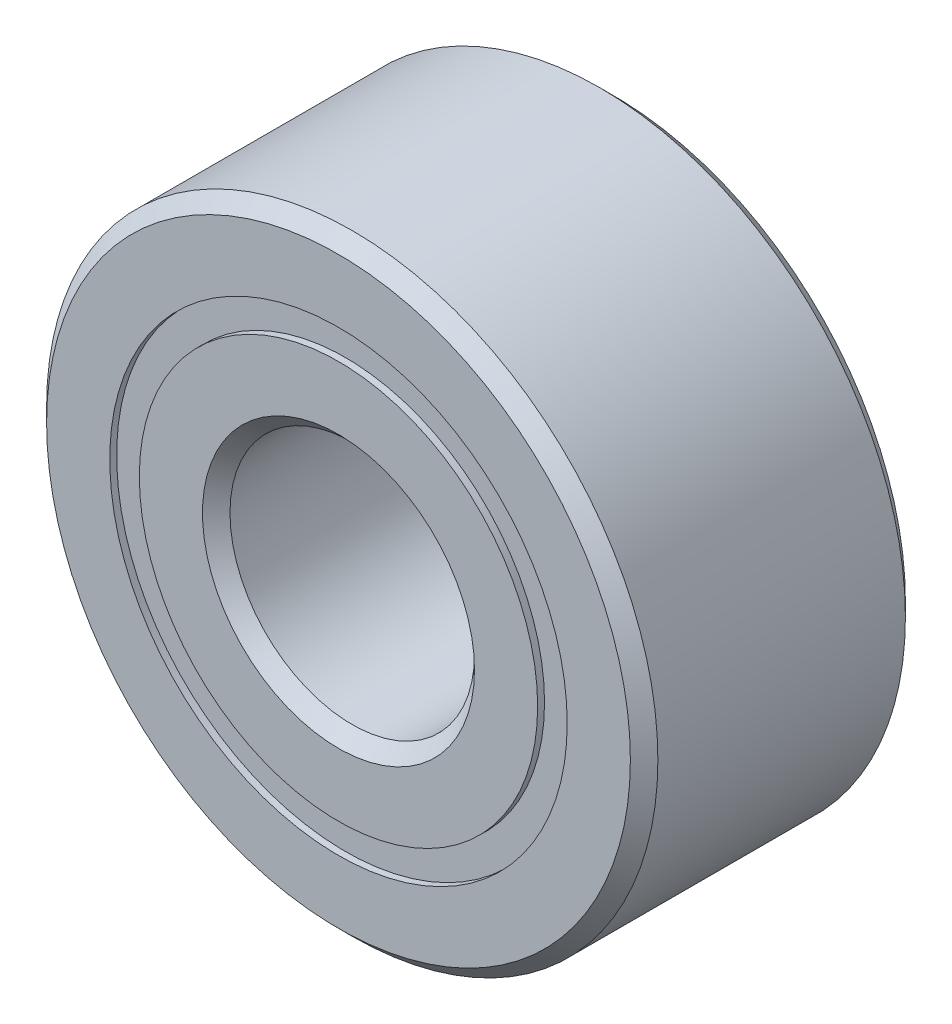
ISO-10303-21;
HEADER;
FILE_DESCRIPTION(('STEP AP214'),'2;1');
FILE_NAME('part.step','',(''),(''),'','','');
FILE_SCHEMA(('AUTOMOTIVE_DESIGN { 1 0 10303 214 1 1 1 1 }'));
ENDSEC;
DATA;
#1=APPLICATION_CONTEXT('core data for automotive mechanical design processes');
#2=APPLICATION_PROTOCOL_DEFINITION('international standard','automotive_design',2000,#1);
#3=PRODUCT_CONTEXT('',#1,'mechanical');
#4=PRODUCT('Part','Part','',(#3));
#5=PRODUCT_RELATED_PRODUCT_CATEGORY('part','',(#4));
#6=PRODUCT_DEFINITION_FORMATION('','',#4);
#7=PRODUCT_DEFINITION_CONTEXT('part definition',#1,'design');
#8=PRODUCT_DEFINITION('design','',#6,#7);
#9=PRODUCT_DEFINITION_SHAPE('','',#8);
#10=(LENGTH_UNIT() NAMED_UNIT(*) SI_UNIT(.MILLI.,.METRE.));
#11=(NAMED_UNIT(*) PLANE_ANGLE_UNIT() SI_UNIT($,.RADIAN.));
#12=(NAMED_UNIT(*) SI_UNIT($,.STERADIAN.) SOLID_ANGLE_UNIT());
#13=UNCERTAINTY_MEASURE_WITH_UNIT(LENGTH_MEASURE(1.E-05),#10,'distance_accuracy_value','');
#14=(GEOMETRIC_REPRESENTATION_CONTEXT(3) GLOBAL_UNCERTAINTY_ASSIGNED_CONTEXT((#13)) GLOBAL_UNIT_ASSIGNED_CONTEXT((#10,
#11,#12)) REPRESENTATION_CONTEXT('',''));
#15=CARTESIAN_POINT('',(0.,0.,0.));
#16=DIRECTION('',(0.,0.,1.));
#17=DIRECTION('',(1.,0.,0.));
#18=AXIS2_PLACEMENT_3D('',#15,#16,#17);
#19=CARTESIAN_POINT('',(0.,2.97004851648352,-1.696339));
#20=DIRECTION('',(0.,0.,1.));
#21=DIRECTION('',(1.,0.,0.));
#22=AXIS2_PLACEMENT_3D('',#19,#20,#21);
#23=PLANE('',#22);
#24=CARTESIAN_POINT('',(0.,0.,-1.696339));
#25=DIRECTION('',(0.,0.,1.));
#26=DIRECTION('',(1.,0.,0.));
#27=AXIS2_PLACEMENT_3D('',#24,#25,#26);
#28=CIRCLE('',#27,2.97004851648352);
#29=CARTESIAN_POINT('',(2.97004851648352,0.,-1.696339));
#30=VERTEX_POINT('',#29);
#31=EDGE_CURVE('E56',#30,#30,#28,.T.);
#32=ORIENTED_EDGE('',*,*,#31,.F.);
#33=EDGE_LOOP('',(#32));
#34=FACE_BOUND('',#33,.T.);
#35=CARTESIAN_POINT('',(0.,0.,-1.696339));
#36=DIRECTION('',(0.,0.,1.));
#37=DIRECTION('',(1.,0.,0.));
#38=AXIS2_PLACEMENT_3D('',#35,#36,#37);
#39=CIRCLE('',#38,2.58620148351648);
#40=CARTESIAN_POINT('',(2.58620148351648,0.,-1.696339));
#41=VERTEX_POINT('',#40);
#42=EDGE_CURVE('E11',#41,#41,#39,.T.);
#43=ORIENTED_EDGE('',*,*,#42,.T.);
#44=EDGE_LOOP('',(#43));
#45=FACE_BOUND('',#44,.T.);
#46=ADVANCED_FACE('F42',(#34,#45),#23,.F.);
#47=CARTESIAN_POINT('',(0.,0.,1.78562));
#48=DIRECTION('',(0.,0.,1.));
#49=DIRECTION('',(1.,0.,0.));
#50=AXIS2_PLACEMENT_3D('',#47,#48,#49);
#51=CYLINDRICAL_SURFACE('',#50,2.58620148351648);
#52=ORIENTED_EDGE('',*,*,#42,.F.);
#53=EDGE_LOOP('',(#52));
#54=FACE_BOUND('',#53,.T.);
#55=CARTESIAN_POINT('',(0.,0.,-0.816486193822563));
#56=DIRECTION('',(0.,0.,1.));
#57=DIRECTION('',(1.,0.,0.));
#58=AXIS2_PLACEMENT_3D('',#55,#56,#57);
#59=CIRCLE('',#58,2.58620148351648);
#60=CARTESIAN_POINT('',(2.58620148351648,0.,-0.816486193822563));
#61=VERTEX_POINT('',#60);
#62=EDGE_CURVE('E48',#61,#61,#59,.T.);
#63=ORIENTED_EDGE('',*,*,#62,.T.);
#64=EDGE_LOOP('',(#63));
#65=FACE_BOUND('',#64,.T.);
#66=ADVANCED_FACE('F65',(#54,#65),#51,.F.);
#67=CARTESIAN_POINT('',(0.,2.97004851648352,-0.816486193822563));
#68=DIRECTION('',(0.,0.,-1.));
#69=DIRECTION('',(-1.,0.,0.));
#70=AXIS2_PLACEMENT_3D('',#67,#68,#69);
#71=PLANE('',#70);
#72=ORIENTED_EDGE('',*,*,#62,.F.);
#73=EDGE_LOOP('',(#72));
#74=FACE_BOUND('',#73,.T.);
#75=CARTESIAN_POINT('',(0.,0.,-0.816486193822563));
#76=DIRECTION('',(0.,0.,1.));
#77=DIRECTION('',(1.,0.,0.));
#78=AXIS2_PLACEMENT_3D('',#75,#76,#77);
#79=CIRCLE('',#78,2.97004851648352);
#80=CARTESIAN_POINT('',(2.97004851648352,0.,-0.816486193822563));
#81=VERTEX_POINT('',#80);
#82=EDGE_CURVE('E52',#81,#81,#79,.T.);
#83=ORIENTED_EDGE('',*,*,#82,.T.);
#84=EDGE_LOOP('',(#83));
#85=FACE_BOUND('',#84,.T.);
#86=ADVANCED_FACE('F69',(#74,#85),#71,.F.);
#87=CARTESIAN_POINT('',(0.,0.,1.78562));
#88=DIRECTION('',(0.,0.,1.));
#89=DIRECTION('',(1.,0.,0.));
#90=AXIS2_PLACEMENT_3D('',#87,#88,#89);
#91=CYLINDRICAL_SURFACE('',#90,2.97004851648352);
#92=ORIENTED_EDGE('',*,*,#82,.F.);
#93=EDGE_LOOP('',(#92));
#94=FACE_BOUND('',#93,.T.);
#95=ORIENTED_EDGE('',*,*,#31,.T.);
#96=EDGE_LOOP('',(#95));
#97=FACE_BOUND('',#96,.T.);
#98=ADVANCED_FACE('F62',(#94,#97),#91,.T.);
#99=CLOSED_SHELL('',(#46,#66,#86,#98));
#100=MANIFOLD_SOLID_BREP('B2',#99);
#101=CARTESIAN_POINT('',(0.,2.97004851648352,1.696339));
#102=DIRECTION('',(0.,0.,-1.));
#103=DIRECTION('',(-1.,0.,0.));
#104=AXIS2_PLACEMENT_3D('',#101,#102,#103);
#105=PLANE('',#104);
#106=CARTESIAN_POINT('',(0.,0.,1.696339));
#107=DIRECTION('',(0.,0.,1.));
#108=DIRECTION('',(1.,0.,0.));
#109=AXIS2_PLACEMENT_3D('',#106,#107,#108);
#110=CIRCLE('',#109,2.58620148351648);
#111=CARTESIAN_POINT('',(2.58620148351648,0.,1.696339));
#112=VERTEX_POINT('',#111);
#113=EDGE_CURVE('E41',#112,#112,#110,.T.);
#114=ORIENTED_EDGE('',*,*,#113,.F.);
#115=EDGE_LOOP('',(#114));
#116=FACE_BOUND('',#115,.T.);
#117=CARTESIAN_POINT('',(0.,0.,1.696339));
#118=DIRECTION('',(0.,0.,1.));
#119=DIRECTION('',(1.,0.,0.));
#120=AXIS2_PLACEMENT_3D('',#117,#118,#119);
#121=CIRCLE('',#120,2.97004851648352);
#122=CARTESIAN_POINT('',(2.97004851648352,0.,1.696339));
#123=VERTEX_POINT('',#122);
#124=EDGE_CURVE('E124',#123,#123,#121,.T.);
#125=ORIENTED_EDGE('',*,*,#124,.T.);
#126=EDGE_LOOP('',(#125));
#127=FACE_BOUND('',#126,.T.);
#128=ADVANCED_FACE('F110',(#116,#127),#105,.F.);
#129=CARTESIAN_POINT('',(0.,0.,1.78562));
#130=DIRECTION('',(0.,0.,1.));
#131=DIRECTION('',(1.,0.,0.));
#132=AXIS2_PLACEMENT_3D('',#129,#130,#131);
#133=CYLINDRICAL_SURFACE('',#132,2.58620148351648);
#134=CARTESIAN_POINT('',(0.,0.,0.816486193822562));
#135=DIRECTION('',(0.,0.,1.));
#136=DIRECTION('',(1.,0.,0.));
#137=AXIS2_PLACEMENT_3D('',#134,#135,#136);
#138=CIRCLE('',#137,2.58620148351648);
#139=CARTESIAN_POINT('',(2.58620148351648,0.,0.816486193822562));
#140=VERTEX_POINT('',#139);
#141=EDGE_CURVE('E116',#140,#140,#138,.T.);
#142=ORIENTED_EDGE('',*,*,#141,.F.);
#143=EDGE_LOOP('',(#142));
#144=FACE_BOUND('',#143,.T.);
#145=ORIENTED_EDGE('',*,*,#113,.T.);
#146=EDGE_LOOP('',(#145));
#147=FACE_BOUND('',#146,.T.);
#148=ADVANCED_FACE('F139',(#144,#147),#133,.F.);
#149=CARTESIAN_POINT('',(0.,2.97004851648352,0.816486193822562));
#150=DIRECTION('',(0.,0.,1.));
#151=DIRECTION('',(1.,0.,0.));
#152=AXIS2_PLACEMENT_3D('',#149,#150,#151);
#153=PLANE('',#152);
#154=CARTESIAN_POINT('',(0.,0.,0.816486193822562));
#155=DIRECTION('',(0.,0.,1.));
#156=DIRECTION('',(1.,0.,0.));
#157=AXIS2_PLACEMENT_3D('',#154,#155,#156);
#158=CIRCLE('',#157,2.97004851648352);
#159=CARTESIAN_POINT('',(2.97004851648352,0.,0.816486193822562));
#160=VERTEX_POINT('',#159);
#161=EDGE_CURVE('E120',#160,#160,#158,.T.);
#162=ORIENTED_EDGE('',*,*,#161,.F.);
#163=EDGE_LOOP('',(#162));
#164=FACE_BOUND('',#163,.T.);
#165=ORIENTED_EDGE('',*,*,#141,.T.);
#166=EDGE_LOOP('',(#165));
#167=FACE_BOUND('',#166,.T.);
#168=ADVANCED_FACE('F134',(#164,#167),#153,.F.);
#169=CARTESIAN_POINT('',(0.,0.,1.78562));
#170=DIRECTION('',(0.,0.,1.));
#171=DIRECTION('',(1.,0.,0.));
#172=AXIS2_PLACEMENT_3D('',#169,#170,#171);
#173=CYLINDRICAL_SURFACE('',#172,2.97004851648352);
#174=ORIENTED_EDGE('',*,*,#124,.F.);
#175=EDGE_LOOP('',(#174));
#176=FACE_BOUND('',#175,.T.);
#177=ORIENTED_EDGE('',*,*,#161,.T.);
#178=EDGE_LOOP('',(#177));
#179=FACE_BOUND('',#178,.T.);
#180=ADVANCED_FACE('F131',(#176,#179),#173,.T.);
#181=CLOSED_SHELL('',(#128,#148,#168,#180));
#182=MANIFOLD_SOLID_BREP('B6',#181);
#183=CARTESIAN_POINT('',(-1.632940904025,2.24755033749792,0.));
#184=DIRECTION('',(0.,0.,1.));
#185=DIRECTION('',(-0.587785252292462,0.809016994374955,0.));
#186=AXIS2_PLACEMENT_3D('',#183,#184,#185);
#187=SPHERICAL_SURFACE('',#186,0.816486193822563);
#188=CARTESIAN_POINT('',(-1.632940904025,2.24755033749792,0.816486193822562));
#189=VERTEX_POINT('',#188);
#190=VERTEX_LOOP('',#189);
#191=FACE_BOUND('',#190,.T.);
#192=ADVANCED_FACE('F177',(#191),#187,.T.);
#193=CLOSED_SHELL('',(#192));
#194=MANIFOLD_SOLID_BREP('B36',#193);
#195=CARTESIAN_POINT('',(-2.64215388433246,0.858487837497931,0.));
#196=DIRECTION('',(0.,0.,1.));
#197=DIRECTION('',(-0.95105651629515,0.309016994374958,0.));
#198=AXIS2_PLACEMENT_3D('',#195,#196,#197);
#199=SPHERICAL_SURFACE('',#198,0.816486193822563);
#200=CARTESIAN_POINT('',(-2.64215388433246,0.858487837497931,0.816486193822562));
#201=VERTEX_POINT('',#200);
#202=VERTEX_LOOP('',#201);
#203=FACE_BOUND('',#202,.T.);
#204=ADVANCED_FACE('F197',(#203),#199,.T.);
#205=CLOSED_SHELL('',(#204));
#206=MANIFOLD_SOLID_BREP('B106',#205);
#207=CARTESIAN_POINT('',(-2.64215388433248,-0.858487837497875,0.));
#208=DIRECTION('',(0.,0.,1.));
#209=DIRECTION('',(-0.951056516295157,-0.309016994374938,0.));
#210=AXIS2_PLACEMENT_3D('',#207,#208,#209);
#211=SPHERICAL_SURFACE('',#210,0.816486193822563);
#212=CARTESIAN_POINT('',(-2.64215388433248,-0.858487837497875,0.816486193822562));
#213=VERTEX_POINT('',#212);
#214=VERTEX_LOOP('',#213);
#215=FACE_BOUND('',#214,.T.);
#216=ADVANCED_FACE('F217',(#215),#211,.T.);
#217=CLOSED_SHELL('',(#216));
#218=MANIFOLD_SOLID_BREP('B173',#217);
#219=CARTESIAN_POINT('',(-1.63294090402505,-2.24755033749789,0.));
#220=DIRECTION('',(0.,0.,1.));
#221=DIRECTION('',(-0.58778525229248,-0.809016994374942,0.));
#222=AXIS2_PLACEMENT_3D('',#219,#220,#221);
#223=SPHERICAL_SURFACE('',#222,0.816486193822563);
#224=CARTESIAN_POINT('',(-1.63294090402505,-2.24755033749789,0.816486193822562));
#225=VERTEX_POINT('',#224);
#226=VERTEX_LOOP('',#225);
#227=FACE_BOUND('',#226,.T.);
#228=ADVANCED_FACE('F237',(#227),#223,.T.);
#229=CLOSED_SHELL('',(#228));
#230=MANIFOLD_SOLID_BREP('B193',#229);
#231=CARTESIAN_POINT('',(0.,-2.778125,0.));
#232=DIRECTION('',(0.,0.,1.));
#233=DIRECTION('',(0.,-1.,0.));
#234=AXIS2_PLACEMENT_3D('',#231,#232,#233);
#235=SPHERICAL_SURFACE('',#234,0.816486193822563);
#236=CARTESIAN_POINT('',(0.,-2.778125,0.816486193822562));
#237=VERTEX_POINT('',#236);
#238=VERTEX_LOOP('',#237);
#239=FACE_BOUND('',#238,.T.);
#240=ADVANCED_FACE('F257',(#239),#235,.T.);
#241=CLOSED_SHELL('',(#240));
#242=MANIFOLD_SOLID_BREP('B213',#241);
#243=CARTESIAN_POINT('',(1.63294090402501,-2.24755033749791,0.));
#244=DIRECTION('',(0.,0.,1.));
#245=DIRECTION('',(0.587785252292469,-0.809016994374951,0.));
#246=AXIS2_PLACEMENT_3D('',#243,#244,#245);
#247=SPHERICAL_SURFACE('',#246,0.816486193822563);
#248=CARTESIAN_POINT('',(1.63294090402501,-2.24755033749791,0.816486193822562));
#249=VERTEX_POINT('',#248);
#250=VERTEX_LOOP('',#249);
#251=FACE_BOUND('',#250,.T.);
#252=ADVANCED_FACE('F277',(#251),#247,.T.);
#253=CLOSED_SHELL('',(#252));
#254=MANIFOLD_SOLID_BREP('B233',#253);
#255=CARTESIAN_POINT('',(2.64215388433247,-0.858487837497912,0.));
#256=DIRECTION('',(0.,0.,1.));
#257=DIRECTION('',(0.951056516295152,-0.309016994374952,0.));
#258=AXIS2_PLACEMENT_3D('',#255,#256,#257);
#259=SPHERICAL_SURFACE('',#258,0.816486193822563);
#260=CARTESIAN_POINT('',(2.64215388433247,-0.858487837497912,0.816486193822562));
#261=VERTEX_POINT('',#260);
#262=VERTEX_LOOP('',#261);
#263=FACE_BOUND('',#262,.T.);
#264=ADVANCED_FACE('F297',(#263),#259,.T.);
#265=CLOSED_SHELL('',(#264));
#266=MANIFOLD_SOLID_BREP('B253',#265);
#267=CARTESIAN_POINT('',(2.64215388433248,0.858487837497893,0.));
#268=DIRECTION('',(0.,0.,1.));
#269=DIRECTION('',(0.951056516295155,0.309016994374945,0.));
#270=AXIS2_PLACEMENT_3D('',#267,#268,#269);
#271=SPHERICAL_SURFACE('',#270,0.816486193822563);
#272=CARTESIAN_POINT('',(2.64215388433248,0.858487837497893,0.816486193822562));
#273=VERTEX_POINT('',#272);
#274=VERTEX_LOOP('',#273);
#275=FACE_BOUND('',#274,.T.);
#276=ADVANCED_FACE('F317',(#275),#271,.T.);
#277=CLOSED_SHELL('',(#276));
#278=MANIFOLD_SOLID_BREP('B273',#277);
#279=CARTESIAN_POINT('',(1.63294090402503,2.2475503374979,0.));
#280=DIRECTION('',(0.,0.,1.));
#281=DIRECTION('',(0.587785252292474,0.809016994374947,0.));
#282=AXIS2_PLACEMENT_3D('',#279,#280,#281);
#283=SPHERICAL_SURFACE('',#282,0.816486193822563);
#284=CARTESIAN_POINT('',(1.63294090402503,2.2475503374979,0.816486193822562));
#285=VERTEX_POINT('',#284);
#286=VERTEX_LOOP('',#285);
#287=FACE_BOUND('',#286,.T.);
#288=ADVANCED_FACE('F337',(#287),#283,.T.);
#289=CLOSED_SHELL('',(#288));
#290=MANIFOLD_SOLID_BREP('B293',#289);
#291=CARTESIAN_POINT('',(0.,2.778125,0.));
#292=DIRECTION('',(0.,0.,1.));
#293=DIRECTION('',(0.,1.,0.));
#294=AXIS2_PLACEMENT_3D('',#291,#292,#293);
#295=SPHERICAL_SURFACE('',#294,0.816486193822563);
#296=CARTESIAN_POINT('',(0.,2.778125,0.816486193822562));
#297=VERTEX_POINT('',#296);
#298=VERTEX_LOOP('',#297);
#299=FACE_BOUND('',#298,.T.);
#300=ADVANCED_FACE('F360',(#299),#295,.T.);
#301=CLOSED_SHELL('',(#300));
#302=MANIFOLD_SOLID_BREP('B313',#301);
#303=CARTESIAN_POINT('',(0.,2.58620148351648,1.78562));
#304=DIRECTION('',(0.,0.,-1.));
#305=DIRECTION('',(-1.,0.,0.));
#306=AXIS2_PLACEMENT_3D('',#303,#304,#305);
#307=PLANE('',#306);
#308=CARTESIAN_POINT('',(0.,0.,1.78562));
#309=DIRECTION('',(0.,0.,1.));
#310=DIRECTION('',(1.,0.,0.));
#311=AXIS2_PLACEMENT_3D('',#308,#309,#310);
#312=CIRCLE('',#311,1.766062);
#313=CARTESIAN_POINT('',(1.766062,0.,1.78562));
#314=VERTEX_POINT('',#313);
#315=EDGE_CURVE('E408',#314,#314,#312,.T.);
#316=ORIENTED_EDGE('',*,*,#315,.F.);
#317=EDGE_LOOP('',(#316));
#318=FACE_BOUND('',#317,.T.);
#319=CARTESIAN_POINT('',(0.,0.,1.78562));
#320=DIRECTION('',(0.,0.,1.));
#321=DIRECTION('',(1.,0.,0.));
#322=AXIS2_PLACEMENT_3D('',#319,#320,#321);
#323=CIRCLE('',#322,2.58620148351648);
#324=CARTESIAN_POINT('',(2.58620148351648,0.,1.78562));
#325=VERTEX_POINT('',#324);
#326=EDGE_CURVE('E359',#325,#325,#323,.T.);
#327=ORIENTED_EDGE('',*,*,#326,.T.);
#328=EDGE_LOOP('',(#327));
#329=FACE_BOUND('',#328,.T.);
#330=ADVANCED_FACE('F380',(#318,#329),#307,.F.);
#331=CARTESIAN_POINT('',(0.,0.,1.78562));
#332=DIRECTION('',(0.,0.,1.));
#333=DIRECTION('',(1.,0.,0.));
#334=AXIS2_PLACEMENT_3D('',#331,#332,#333);
#335=CYLINDRICAL_SURFACE('',#334,2.58620148351648);
#336=ORIENTED_EDGE('',*,*,#326,.F.);
#337=EDGE_LOOP('',(#336));
#338=FACE_BOUND('',#337,.T.);
#339=CARTESIAN_POINT('',(0.,0.,0.793608888888889));
#340=DIRECTION('',(0.,0.,1.));
#341=DIRECTION('',(1.,0.,0.));
#342=AXIS2_PLACEMENT_3D('',#339,#340,#341);
#343=CIRCLE('',#342,2.58620148351648);
#344=CARTESIAN_POINT('',(2.58620148351648,0.,0.793608888888889));
#345=VERTEX_POINT('',#344);
#346=EDGE_CURVE('E386',#345,#345,#343,.T.);
#347=ORIENTED_EDGE('',*,*,#346,.T.);
#348=EDGE_LOOP('',(#347));
#349=FACE_BOUND('',#348,.T.);
#350=ADVANCED_FACE('F415',(#338,#349),#335,.T.);
#351=CARTESIAN_POINT('',(0.,0.,0.));
#352=DIRECTION('',(0.,0.,1.));
#353=DIRECTION('',(1.,0.,0.));
#354=AXIS2_PLACEMENT_3D('',#351,#352,#353);
#355=TOROIDAL_SURFACE('',#354,2.77812499999999,0.816486193822561);
#356=ORIENTED_EDGE('',*,*,#346,.F.);
#357=EDGE_LOOP('',(#356));
#358=FACE_BOUND('',#357,.T.);
#359=CARTESIAN_POINT('',(0.,0.,-0.793608888888891));
#360=DIRECTION('',(0.,0.,1.));
#361=DIRECTION('',(1.,0.,0.));
#362=AXIS2_PLACEMENT_3D('',#359,#360,#361);
#363=CIRCLE('',#362,2.58620148351648);
#364=CARTESIAN_POINT('',(2.58620148351648,0.,-0.793608888888891));
#365=VERTEX_POINT('',#364);
#366=EDGE_CURVE('E390',#365,#365,#363,.T.);
#367=ORIENTED_EDGE('',*,*,#366,.T.);
#368=EDGE_LOOP('',(#367));
#369=FACE_BOUND('',#368,.T.);
#370=ADVANCED_FACE('F419',(#358,#369),#355,.F.);
#371=CARTESIAN_POINT('',(0.,0.,1.78562));
#372=DIRECTION('',(0.,0.,1.));
#373=DIRECTION('',(1.,0.,0.));
#374=AXIS2_PLACEMENT_3D('',#371,#372,#373);
#375=CYLINDRICAL_SURFACE('',#374,2.58620148351648);
#376=ORIENTED_EDGE('',*,*,#366,.F.);
#377=EDGE_LOOP('',(#376));
#378=FACE_BOUND('',#377,.T.);
#379=CARTESIAN_POINT('',(0.,0.,-1.78562));
#380=DIRECTION('',(0.,0.,1.));
#381=DIRECTION('',(1.,0.,0.));
#382=AXIS2_PLACEMENT_3D('',#379,#380,#381);
#383=CIRCLE('',#382,2.58620148351648);
#384=CARTESIAN_POINT('',(2.58620148351648,0.,-1.78562));
#385=VERTEX_POINT('',#384);
#386=EDGE_CURVE('E394',#385,#385,#383,.T.);
#387=ORIENTED_EDGE('',*,*,#386,.T.);
#388=EDGE_LOOP('',(#387));
#389=FACE_BOUND('',#388,.T.);
#390=ADVANCED_FACE('F424',(#378,#389),#375,.T.);
#391=CARTESIAN_POINT('',(0.,1.766062,-1.78562));
#392=DIRECTION('',(0.,0.,1.));
#393=DIRECTION('',(1.,0.,0.));
#394=AXIS2_PLACEMENT_3D('',#391,#392,#393);
#395=PLANE('',#394);
#396=ORIENTED_EDGE('',*,*,#386,.F.);
#397=EDGE_LOOP('',(#396));
#398=FACE_BOUND('',#397,.T.);
#399=CARTESIAN_POINT('',(0.,0.,-1.78562));
#400=DIRECTION('',(0.,0.,1.));
#401=DIRECTION('',(1.,0.,0.));
#402=AXIS2_PLACEMENT_3D('',#399,#400,#401);
#403=CIRCLE('',#402,1.766062);
#404=CARTESIAN_POINT('',(1.766062,0.,-1.78562));
#405=VERTEX_POINT('',#404);
#406=EDGE_CURVE('E399',#405,#405,#403,.T.);
#407=ORIENTED_EDGE('',*,*,#406,.T.);
#408=EDGE_LOOP('',(#407));
#409=FACE_BOUND('',#408,.T.);
#410=ADVANCED_FACE('F430',(#398,#409),#395,.F.);
#411=CARTESIAN_POINT('',(0.,0.,-1.607058));
#412=DIRECTION('',(0.,0.,-1.));
#413=DIRECTION('',(-1.,0.,0.));
#414=AXIS2_PLACEMENT_3D('',#411,#412,#413);
#415=CONICAL_SURFACE('',#414,1.5875,0.785398163397451);
#416=ORIENTED_EDGE('',*,*,#406,.F.);
#417=EDGE_LOOP('',(#416));
#418=FACE_BOUND('',#417,.T.);
#419=CARTESIAN_POINT('',(0.,0.,-1.607058));
#420=DIRECTION('',(0.,0.,1.));
#421=DIRECTION('',(1.,0.,0.));
#422=AXIS2_PLACEMENT_3D('',#419,#420,#421);
#423=CIRCLE('',#422,1.5875);
#424=CARTESIAN_POINT('',(1.5875,0.,-1.607058));
#425=VERTEX_POINT('',#424);
#426=EDGE_CURVE('E402',#425,#425,#423,.T.);
#427=ORIENTED_EDGE('',*,*,#426,.T.);
#428=EDGE_LOOP('',(#427));
#429=FACE_BOUND('',#428,.T.);
#430=ADVANCED_FACE('F434',(#418,#429),#415,.F.);
#431=CARTESIAN_POINT('',(0.,0.,1.78562));
#432=DIRECTION('',(0.,0.,1.));
#433=DIRECTION('',(1.,0.,0.));
#434=AXIS2_PLACEMENT_3D('',#431,#432,#433);
#435=CYLINDRICAL_SURFACE('',#434,1.5875);
#436=ORIENTED_EDGE('',*,*,#426,.F.);
#437=EDGE_LOOP('',(#436));
#438=FACE_BOUND('',#437,.T.);
#439=CARTESIAN_POINT('',(0.,0.,1.607058));
#440=DIRECTION('',(0.,0.,1.));
#441=DIRECTION('',(1.,0.,0.));
#442=AXIS2_PLACEMENT_3D('',#439,#440,#441);
#443=CIRCLE('',#442,1.5875);
#444=CARTESIAN_POINT('',(1.5875,0.,1.607058));
#445=VERTEX_POINT('',#444);
#446=EDGE_CURVE('E405',#445,#445,#443,.T.);
#447=ORIENTED_EDGE('',*,*,#446,.T.);
#448=EDGE_LOOP('',(#447));
#449=FACE_BOUND('',#448,.T.);
#450=ADVANCED_FACE('F438',(#438,#449),#435,.F.);
#451=CARTESIAN_POINT('',(0.,0.,1.78562));
#452=DIRECTION('',(0.,0.,1.));
#453=DIRECTION('',(1.,0.,0.));
#454=AXIS2_PLACEMENT_3D('',#451,#452,#453);
#455=CONICAL_SURFACE('',#454,1.766062,0.785398163397447);
#456=ORIENTED_EDGE('',*,*,#446,.F.);
#457=EDGE_LOOP('',(#456));
#458=FACE_BOUND('',#457,.T.);
#459=ORIENTED_EDGE('',*,*,#315,.T.);
#460=EDGE_LOOP('',(#459));
#461=FACE_BOUND('',#460,.T.);
#462=ADVANCED_FACE('F412',(#458,#461),#455,.F.);
#463=CLOSED_SHELL('',(#330,#350,#370,#390,#410,#430,#450,#462));
#464=MANIFOLD_SOLID_BREP('B333',#463);
#465=CARTESIAN_POINT('',(0.,0.,1.607058));
#466=DIRECTION('',(0.,0.,-1.));
#467=DIRECTION('',(-1.,0.,0.));
#468=AXIS2_PLACEMENT_3D('',#465,#466,#467);
#469=CONICAL_SURFACE('',#468,3.96875,0.785398163397447);
#470=CARTESIAN_POINT('',(0.,0.,1.78562));
#471=DIRECTION('',(0.,0.,1.));
#472=DIRECTION('',(1.,0.,0.));
#473=AXIS2_PLACEMENT_3D('',#470,#471,#472);
#474=CIRCLE('',#473,3.790188);
#475=CARTESIAN_POINT('',(3.790188,0.,1.78562));
#476=VERTEX_POINT('',#475);
#477=EDGE_CURVE('E530',#476,#476,#474,.T.);
#478=ORIENTED_EDGE('',*,*,#477,.F.);
#479=EDGE_LOOP('',(#478));
#480=FACE_BOUND('',#479,.T.);
#481=CARTESIAN_POINT('',(0.,0.,1.607058));
#482=DIRECTION('',(0.,0.,1.));
#483=DIRECTION('',(1.,0.,0.));
#484=AXIS2_PLACEMENT_3D('',#481,#482,#483);
#485=CIRCLE('',#484,3.96875);
#486=CARTESIAN_POINT('',(3.96875,0.,1.607058));
#487=VERTEX_POINT('',#486);
#488=EDGE_CURVE('E379',#487,#487,#485,.T.);
#489=ORIENTED_EDGE('',*,*,#488,.T.);
#490=EDGE_LOOP('',(#489));
#491=FACE_BOUND('',#490,.T.);
#492=ADVANCED_FACE('F502',(#480,#491),#469,.T.);
#493=CARTESIAN_POINT('',(0.,0.,1.78562));
#494=DIRECTION('',(0.,0.,1.));
#495=DIRECTION('',(1.,0.,0.));
#496=AXIS2_PLACEMENT_3D('',#493,#494,#495);
#497=CYLINDRICAL_SURFACE('',#496,3.96875);
#498=ORIENTED_EDGE('',*,*,#488,.F.);
#499=EDGE_LOOP('',(#498));
#500=FACE_BOUND('',#499,.T.);
#501=CARTESIAN_POINT('',(0.,0.,-1.607058));
#502=DIRECTION('',(0.,0.,1.));
#503=DIRECTION('',(1.,0.,0.));
#504=AXIS2_PLACEMENT_3D('',#501,#502,#503);
#505=CIRCLE('',#504,3.96875);
#506=CARTESIAN_POINT('',(3.96875,0.,-1.607058));
#507=VERTEX_POINT('',#506);
#508=EDGE_CURVE('E508',#507,#507,#505,.T.);
#509=ORIENTED_EDGE('',*,*,#508,.T.);
#510=EDGE_LOOP('',(#509));
#511=FACE_BOUND('',#510,.T.);
#512=ADVANCED_FACE('F537',(#500,#511),#497,.T.);
#513=CARTESIAN_POINT('',(0.,0.,-1.78562));
#514=DIRECTION('',(0.,0.,1.));
#515=DIRECTION('',(1.,0.,0.));
#516=AXIS2_PLACEMENT_3D('',#513,#514,#515);
#517=CONICAL_SURFACE('',#516,3.790188,0.785398163397446);
#518=ORIENTED_EDGE('',*,*,#508,.F.);
#519=EDGE_LOOP('',(#518));
#520=FACE_BOUND('',#519,.T.);
#521=CARTESIAN_POINT('',(0.,0.,-1.78562));
#522=DIRECTION('',(0.,0.,1.));
#523=DIRECTION('',(1.,0.,0.));
#524=AXIS2_PLACEMENT_3D('',#521,#522,#523);
#525=CIRCLE('',#524,3.790188);
#526=CARTESIAN_POINT('',(3.790188,0.,-1.78562));
#527=VERTEX_POINT('',#526);
#528=EDGE_CURVE('E512',#527,#527,#525,.T.);
#529=ORIENTED_EDGE('',*,*,#528,.T.);
#530=EDGE_LOOP('',(#529));
#531=FACE_BOUND('',#530,.T.);
#532=ADVANCED_FACE('F541',(#520,#531),#517,.T.);
#533=CARTESIAN_POINT('',(0.,3.790188,-1.78562));
#534=DIRECTION('',(0.,0.,1.));
#535=DIRECTION('',(1.,0.,0.));
#536=AXIS2_PLACEMENT_3D('',#533,#534,#535);
#537=PLANE('',#536);
#538=ORIENTED_EDGE('',*,*,#528,.F.);
#539=EDGE_LOOP('',(#538));
#540=FACE_BOUND('',#539,.T.);
#541=CARTESIAN_POINT('',(0.,0.,-1.78562));
#542=DIRECTION('',(0.,0.,1.));
#543=DIRECTION('',(1.,0.,0.));
#544=AXIS2_PLACEMENT_3D('',#541,#542,#543);
#545=CIRCLE('',#544,2.97004851648352);
#546=CARTESIAN_POINT('',(2.97004851648352,0.,-1.78562));
#547=VERTEX_POINT('',#546);
#548=EDGE_CURVE('E516',#547,#547,#545,.T.);
#549=ORIENTED_EDGE('',*,*,#548,.T.);
#550=EDGE_LOOP('',(#549));
#551=FACE_BOUND('',#550,.T.);
#552=ADVANCED_FACE('F546',(#540,#551),#537,.F.);
#553=CARTESIAN_POINT('',(0.,0.,1.78562));
#554=DIRECTION('',(0.,0.,1.));
#555=DIRECTION('',(1.,0.,0.));
#556=AXIS2_PLACEMENT_3D('',#553,#554,#555);
#557=CYLINDRICAL_SURFACE('',#556,2.97004851648352);
#558=ORIENTED_EDGE('',*,*,#548,.F.);
#559=EDGE_LOOP('',(#558));
#560=FACE_BOUND('',#559,.T.);
#561=CARTESIAN_POINT('',(0.,0.,-0.793608888888889));
#562=DIRECTION('',(0.,0.,1.));
#563=DIRECTION('',(1.,0.,0.));
#564=AXIS2_PLACEMENT_3D('',#561,#562,#563);
#565=CIRCLE('',#564,2.97004851648352);
#566=CARTESIAN_POINT('',(2.97004851648352,0.,-0.793608888888889));
#567=VERTEX_POINT('',#566);
#568=EDGE_CURVE('E521',#567,#567,#565,.T.);
#569=ORIENTED_EDGE('',*,*,#568,.T.);
#570=EDGE_LOOP('',(#569));
#571=FACE_BOUND('',#570,.T.);
#572=ADVANCED_FACE('F552',(#560,#571),#557,.F.);
#573=CARTESIAN_POINT('',(0.,0.,0.));
#574=DIRECTION('',(0.,0.,1.));
#575=DIRECTION('',(1.,0.,0.));
#576=AXIS2_PLACEMENT_3D('',#573,#574,#575);
#577=TOROIDAL_SURFACE('',#576,2.778125,0.816486193822563);
#578=ORIENTED_EDGE('',*,*,#568,.F.);
#579=EDGE_LOOP('',(#578));
#580=FACE_BOUND('',#579,.T.);
#581=CARTESIAN_POINT('',(0.,0.,0.793608888888888));
#582=DIRECTION('',(0.,0.,1.));
#583=DIRECTION('',(1.,0.,0.));
#584=AXIS2_PLACEMENT_3D('',#581,#582,#583);
#585=CIRCLE('',#584,2.97004851648352);
#586=CARTESIAN_POINT('',(2.97004851648352,0.,0.793608888888888));
#587=VERTEX_POINT('',#586);
#588=EDGE_CURVE('E524',#587,#587,#585,.T.);
#589=ORIENTED_EDGE('',*,*,#588,.T.);
#590=EDGE_LOOP('',(#589));
#591=FACE_BOUND('',#590,.T.);
#592=ADVANCED_FACE('F556',(#580,#591),#577,.F.);
#593=CARTESIAN_POINT('',(0.,0.,1.78562));
#594=DIRECTION('',(0.,0.,1.));
#595=DIRECTION('',(1.,0.,0.));
#596=AXIS2_PLACEMENT_3D('',#593,#594,#595);
#597=CYLINDRICAL_SURFACE('',#596,2.97004851648352);
#598=ORIENTED_EDGE('',*,*,#588,.F.);
#599=EDGE_LOOP('',(#598));
#600=FACE_BOUND('',#599,.T.);
#601=CARTESIAN_POINT('',(0.,0.,1.78562));
#602=DIRECTION('',(0.,0.,1.));
#603=DIRECTION('',(1.,0.,0.));
#604=AXIS2_PLACEMENT_3D('',#601,#602,#603);
#605=CIRCLE('',#604,2.97004851648352);
#606=CARTESIAN_POINT('',(2.97004851648352,0.,1.78562));
#607=VERTEX_POINT('',#606);
#608=EDGE_CURVE('E527',#607,#607,#605,.T.);
#609=ORIENTED_EDGE('',*,*,#608,.T.);
#610=EDGE_LOOP('',(#609));
#611=FACE_BOUND('',#610,.T.);
#612=ADVANCED_FACE('F560',(#600,#611),#597,.F.);
#613=CARTESIAN_POINT('',(0.,3.790188,1.78562));
#614=DIRECTION('',(0.,0.,-1.));
#615=DIRECTION('',(-1.,0.,0.));
#616=AXIS2_PLACEMENT_3D('',#613,#614,#615);
#617=PLANE('',#616);
#618=ORIENTED_EDGE('',*,*,#608,.F.);
#619=EDGE_LOOP('',(#618));
#620=FACE_BOUND('',#619,.T.);
#621=ORIENTED_EDGE('',*,*,#477,.T.);
#622=EDGE_LOOP('',(#621));
#623=FACE_BOUND('',#622,.T.);
#624=ADVANCED_FACE('F534',(#620,#623),#617,.F.);
#625=CLOSED_SHELL('',(#492,#512,#532,#552,#572,#592,#612,#624));
#626=MANIFOLD_SOLID_BREP('B354',#625);
#627=ADVANCED_BREP_SHAPE_REPRESENTATION('',(#18,#100,#182,#194,#206,#218,#230,#242,#254,#266,
#278,#290,#302,#464,#626),#14);
#628=SHAPE_DEFINITION_REPRESENTATION(#9,#627);
ENDSEC;
END-ISO-10303-21;
